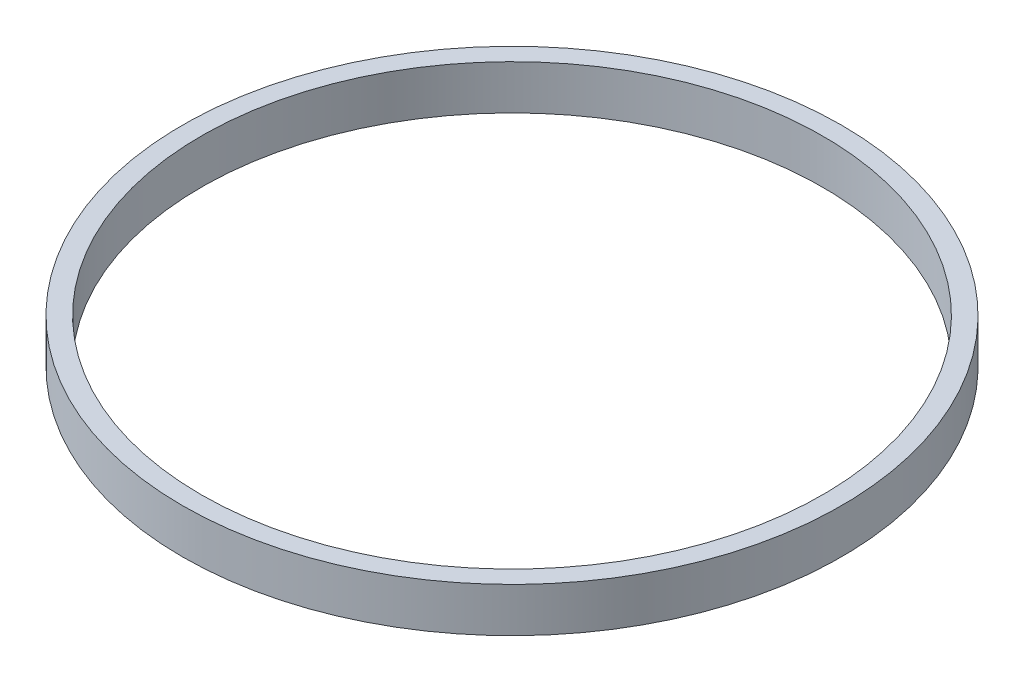
ISO-10303-21;
HEADER;
FILE_DESCRIPTION(('STEP AP214'),'2;1');
FILE_NAME('part.step','',(''),(''),'','','');
FILE_SCHEMA(('AUTOMOTIVE_DESIGN { 1 0 10303 214 1 1 1 1 }'));
ENDSEC;
DATA;
#1=APPLICATION_CONTEXT('core data for automotive mechanical design processes');
#2=APPLICATION_PROTOCOL_DEFINITION('international standard','automotive_design',2000,#1);
#3=PRODUCT_CONTEXT('',#1,'mechanical');
#4=PRODUCT('Part','Part','',(#3));
#5=PRODUCT_RELATED_PRODUCT_CATEGORY('part','',(#4));
#6=PRODUCT_DEFINITION_FORMATION('','',#4);
#7=PRODUCT_DEFINITION_CONTEXT('part definition',#1,'design');
#8=PRODUCT_DEFINITION('design','',#6,#7);
#9=PRODUCT_DEFINITION_SHAPE('','',#8);
#10=(LENGTH_UNIT() NAMED_UNIT(*) SI_UNIT(.MILLI.,.METRE.));
#11=(NAMED_UNIT(*) PLANE_ANGLE_UNIT() SI_UNIT($,.RADIAN.));
#12=(NAMED_UNIT(*) SI_UNIT($,.STERADIAN.) SOLID_ANGLE_UNIT());
#13=UNCERTAINTY_MEASURE_WITH_UNIT(LENGTH_MEASURE(1.E-05),#10,'distance_accuracy_value','');
#14=(GEOMETRIC_REPRESENTATION_CONTEXT(3) GLOBAL_UNCERTAINTY_ASSIGNED_CONTEXT((#13)) GLOBAL_UNIT_ASSIGNED_CONTEXT((#10,
#11,#12)) REPRESENTATION_CONTEXT('',''));
#15=CARTESIAN_POINT('',(0.,0.,0.));
#16=DIRECTION('',(0.,0.,1.));
#17=DIRECTION('',(1.,0.,0.));
#18=AXIS2_PLACEMENT_3D('',#15,#16,#17);
#19=CARTESIAN_POINT('',(0.,-6.35,0.));
#20=DIRECTION('',(0.,1.,0.));
#21=DIRECTION('',(0.,0.,1.));
#22=AXIS2_PLACEMENT_3D('',#19,#20,#21);
#23=CYLINDRICAL_SURFACE('',#22,47.1424);
#24=CARTESIAN_POINT('',(0.,-6.35,0.));
#25=DIRECTION('',(0.,1.,0.));
#26=DIRECTION('',(0.,0.,1.));
#27=AXIS2_PLACEMENT_3D('',#24,#25,#26);
#28=CIRCLE('',#27,47.1424);
#29=CARTESIAN_POINT('',(0.,-6.35,47.1424));
#30=VERTEX_POINT('',#29);
#31=EDGE_CURVE('E10',#30,#30,#28,.T.);
#32=ORIENTED_EDGE('',*,*,#31,.T.);
#33=EDGE_LOOP('',(#32));
#34=FACE_BOUND('',#33,.T.);
#35=CARTESIAN_POINT('',(0.,0.,0.));
#36=DIRECTION('',(0.,1.,0.));
#37=DIRECTION('',(0.,0.,1.));
#38=AXIS2_PLACEMENT_3D('',#35,#36,#37);
#39=CIRCLE('',#38,47.1424);
#40=CARTESIAN_POINT('',(0.,0.,47.1424));
#41=VERTEX_POINT('',#40);
#42=EDGE_CURVE('E364',#41,#41,#39,.T.);
#43=ORIENTED_EDGE('',*,*,#42,.F.);
#44=EDGE_LOOP('',(#43));
#45=FACE_BOUND('',#44,.T.);
#46=ADVANCED_FACE('F358',(#34,#45),#23,.T.);
#47=CARTESIAN_POINT('',(0.,-6.35,0.));
#48=DIRECTION('',(0.,1.,0.));
#49=DIRECTION('',(0.,0.,1.));
#50=AXIS2_PLACEMENT_3D('',#47,#48,#49);
#51=PLANE('',#50);
#52=CARTESIAN_POINT('',(0.,-6.35,0.));
#53=DIRECTION('',(0.,1.,0.));
#54=DIRECTION('',(0.,0.,1.));
#55=AXIS2_PLACEMENT_3D('',#52,#53,#54);
#56=CIRCLE('',#55,44.45);
#57=CARTESIAN_POINT('',(0.,-6.35,44.45));
#58=VERTEX_POINT('',#57);
#59=EDGE_CURVE('E368',#58,#58,#56,.T.);
#60=ORIENTED_EDGE('',*,*,#59,.T.);
#61=EDGE_LOOP('',(#60));
#62=FACE_BOUND('',#61,.T.);
#63=ORIENTED_EDGE('',*,*,#31,.F.);
#64=EDGE_LOOP('',(#63));
#65=FACE_BOUND('',#64,.T.);
#66=ADVANCED_FACE('F382',(#62,#65),#51,.F.);
#67=CARTESIAN_POINT('',(0.,0.,0.));
#68=DIRECTION('',(0.,1.,0.));
#69=DIRECTION('',(0.,0.,1.));
#70=AXIS2_PLACEMENT_3D('',#67,#68,#69);
#71=PLANE('',#70);
#72=CARTESIAN_POINT('',(0.,0.,0.));
#73=DIRECTION('',(0.,1.,0.));
#74=DIRECTION('',(0.,0.,1.));
#75=AXIS2_PLACEMENT_3D('',#72,#73,#74);
#76=CIRCLE('',#75,44.45);
#77=CARTESIAN_POINT('',(0.,0.,44.45));
#78=VERTEX_POINT('',#77);
#79=EDGE_CURVE('E372',#78,#78,#76,.T.);
#80=ORIENTED_EDGE('',*,*,#79,.F.);
#81=EDGE_LOOP('',(#80));
#82=FACE_BOUND('',#81,.T.);
#83=ORIENTED_EDGE('',*,*,#42,.T.);
#84=EDGE_LOOP('',(#83));
#85=FACE_BOUND('',#84,.T.);
#86=ADVANCED_FACE('F380',(#82,#85),#71,.T.);
#87=CARTESIAN_POINT('',(0.,-6.35,0.));
#88=DIRECTION('',(0.,1.,0.));
#89=DIRECTION('',(0.,0.,1.));
#90=AXIS2_PLACEMENT_3D('',#87,#88,#89);
#91=CYLINDRICAL_SURFACE('',#90,44.45);
#92=ORIENTED_EDGE('',*,*,#59,.F.);
#93=EDGE_LOOP('',(#92));
#94=FACE_BOUND('',#93,.T.);
#95=ORIENTED_EDGE('',*,*,#79,.T.);
#96=EDGE_LOOP('',(#95));
#97=FACE_BOUND('',#96,.T.);
#98=ADVANCED_FACE('F378',(#94,#97),#91,.F.);
#99=CLOSED_SHELL('',(#46,#66,#86,#98));
#100=MANIFOLD_SOLID_BREP('B2',#99);
#101=ADVANCED_BREP_SHAPE_REPRESENTATION('',(#18,#100),#14);
#102=SHAPE_DEFINITION_REPRESENTATION(#9,#101);
ENDSEC;
END-ISO-10303-21;
